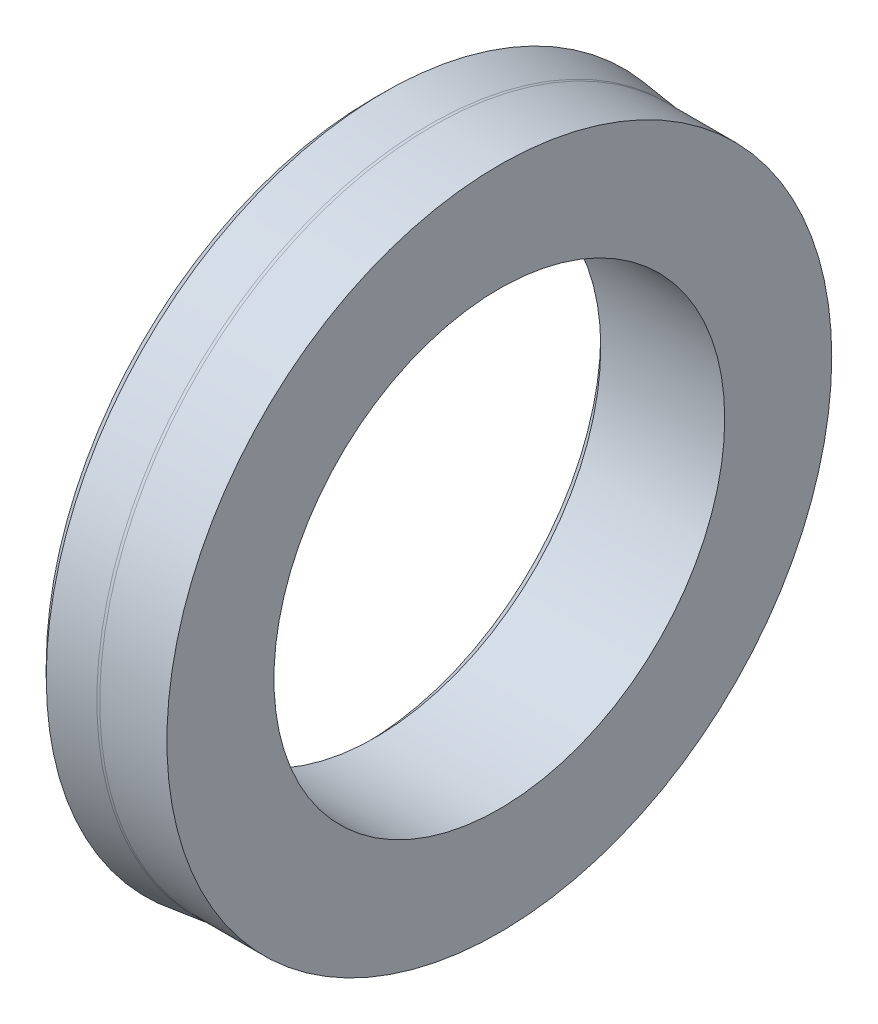
ISO-10303-21;
HEADER;
FILE_DESCRIPTION(('STEP AP214'),'2;1');
FILE_NAME('part.step','',(''),(''),'','','');
FILE_SCHEMA(('AUTOMOTIVE_DESIGN { 1 0 10303 214 1 1 1 1 }'));
ENDSEC;
DATA;
#1=APPLICATION_CONTEXT('core data for automotive mechanical design processes');
#2=APPLICATION_PROTOCOL_DEFINITION('international standard','automotive_design',2000,#1);
#3=PRODUCT_CONTEXT('',#1,'mechanical');
#4=PRODUCT('Part','Part','',(#3));
#5=PRODUCT_RELATED_PRODUCT_CATEGORY('part','',(#4));
#6=PRODUCT_DEFINITION_FORMATION('','',#4);
#7=PRODUCT_DEFINITION_CONTEXT('part definition',#1,'design');
#8=PRODUCT_DEFINITION('design','',#6,#7);
#9=PRODUCT_DEFINITION_SHAPE('','',#8);
#10=(LENGTH_UNIT() NAMED_UNIT(*) SI_UNIT(.MILLI.,.METRE.));
#11=(NAMED_UNIT(*) PLANE_ANGLE_UNIT() SI_UNIT($,.RADIAN.));
#12=(NAMED_UNIT(*) SI_UNIT($,.STERADIAN.) SOLID_ANGLE_UNIT());
#13=UNCERTAINTY_MEASURE_WITH_UNIT(LENGTH_MEASURE(1.E-05),#10,'distance_accuracy_value','');
#14=(GEOMETRIC_REPRESENTATION_CONTEXT(3) GLOBAL_UNCERTAINTY_ASSIGNED_CONTEXT((#13)) GLOBAL_UNIT_ASSIGNED_CONTEXT((#10,
#11,#12)) REPRESENTATION_CONTEXT('',''));
#15=CARTESIAN_POINT('',(0.,0.,0.));
#16=DIRECTION('',(0.,0.,1.));
#17=DIRECTION('',(1.,0.,0.));
#18=AXIS2_PLACEMENT_3D('',#15,#16,#17);
#19=CARTESIAN_POINT('',(584.921248789932,446.502634686379,0.));
#20=DIRECTION('',(-1.,0.,0.));
#21=DIRECTION('',(0.,0.,1.));
#22=AXIS2_PLACEMENT_3D('',#19,#20,#21);
#23=CONICAL_SURFACE('',#22,21.,0.785398163397448);
#24=CARTESIAN_POINT('',(585.921248789932,446.502634686379,0.));
#25=DIRECTION('',(1.,0.,0.));
#26=DIRECTION('',(0.,0.,-1.));
#27=AXIS2_PLACEMENT_3D('',#24,#25,#26);
#28=CIRCLE('',#27,20.);
#29=CARTESIAN_POINT('',(585.921248789932,446.502634686379,-20.));
#30=VERTEX_POINT('',#29);
#31=EDGE_CURVE('E70',#30,#30,#28,.T.);
#32=ORIENTED_EDGE('',*,*,#31,.T.);
#33=EDGE_LOOP('',(#32));
#34=FACE_BOUND('',#33,.T.);
#35=CARTESIAN_POINT('',(584.921248789932,446.502634686379,0.));
#36=DIRECTION('',(1.,0.,0.));
#37=DIRECTION('',(0.,0.,-1.));
#38=AXIS2_PLACEMENT_3D('',#35,#36,#37);
#39=CIRCLE('',#38,21.);
#40=CARTESIAN_POINT('',(584.921248789932,446.502634686379,-21.));
#41=VERTEX_POINT('',#40);
#42=EDGE_CURVE('E10',#41,#41,#39,.T.);
#43=ORIENTED_EDGE('',*,*,#42,.F.);
#44=EDGE_LOOP('',(#43));
#45=FACE_BOUND('',#44,.T.);
#46=ADVANCED_FACE('F30',(#34,#45),#23,.F.);
#47=CARTESIAN_POINT('',(584.921248789932,470.502634686379,0.));
#48=DIRECTION('',(-1.,0.,0.));
#49=DIRECTION('',(0.,0.,1.));
#50=AXIS2_PLACEMENT_3D('',#47,#48,#49);
#51=PLANE('',#50);
#52=ORIENTED_EDGE('',*,*,#42,.T.);
#53=EDGE_LOOP('',(#52));
#54=FACE_BOUND('',#53,.T.);
#55=CARTESIAN_POINT('',(584.921248789932,446.502634686379,0.));
#56=DIRECTION('',(1.,0.,0.));
#57=DIRECTION('',(0.,0.,-1.));
#58=AXIS2_PLACEMENT_3D('',#55,#56,#57);
#59=CIRCLE('',#58,24.);
#60=CARTESIAN_POINT('',(584.921248789932,446.502634686379,-24.));
#61=VERTEX_POINT('',#60);
#62=EDGE_CURVE('E36',#61,#61,#59,.T.);
#63=ORIENTED_EDGE('',*,*,#62,.F.);
#64=EDGE_LOOP('',(#63));
#65=FACE_BOUND('',#64,.T.);
#66=ADVANCED_FACE('F88',(#54,#65),#51,.T.);
#67=CARTESIAN_POINT('',(596.921248789932,446.502634686379,0.));
#68=DIRECTION('',(1.,0.,0.));
#69=DIRECTION('',(0.,0.,-1.));
#70=AXIS2_PLACEMENT_3D('',#67,#68,#69);
#71=CYLINDRICAL_SURFACE('',#70,23.9999999999999);
#72=ORIENTED_EDGE('',*,*,#62,.T.);
#73=EDGE_LOOP('',(#72));
#74=FACE_BOUND('',#73,.T.);
#75=CARTESIAN_POINT('',(589.403609649424,446.502634686379,0.));
#76=DIRECTION('',(1.,0.,0.));
#77=DIRECTION('',(0.,0.,-1.));
#78=AXIS2_PLACEMENT_3D('',#75,#76,#77);
#79=CIRCLE('',#78,23.9999999999999);
#80=CARTESIAN_POINT('',(589.403609649424,446.502634686379,-23.9999999999999));
#81=VERTEX_POINT('',#80);
#82=EDGE_CURVE('E40',#81,#81,#79,.T.);
#83=ORIENTED_EDGE('',*,*,#82,.F.);
#84=EDGE_LOOP('',(#83));
#85=FACE_BOUND('',#84,.T.);
#86=ADVANCED_FACE('F92',(#74,#85),#71,.T.);
#87=CARTESIAN_POINT('',(589.403609649424,446.502634686379,0.));
#88=DIRECTION('',(1.,0.,0.));
#89=DIRECTION('',(0.,0.,-1.));
#90=AXIS2_PLACEMENT_3D('',#87,#88,#89);
#91=TOROIDAL_SURFACE('',#90,24.8176391405087,0.817639140508125);
#92=ORIENTED_EDGE('',*,*,#82,.T.);
#93=EDGE_LOOP('',(#92));
#94=FACE_BOUND('',#93,.T.);
#95=CARTESIAN_POINT('',(589.503056579504,446.502634686379,0.));
#96=DIRECTION('',(1.,0.,0.));
#97=DIRECTION('',(0.,0.,-1.));
#98=AXIS2_PLACEMENT_3D('',#95,#96,#97);
#99=CIRCLE('',#98,25.629208036036);
#100=CARTESIAN_POINT('',(589.503056579504,446.502634686379,-25.629208036036));
#101=VERTEX_POINT('',#100);
#102=EDGE_CURVE('E44',#101,#101,#99,.T.);
#103=ORIENTED_EDGE('',*,*,#102,.F.);
#104=EDGE_LOOP('',(#103));
#105=FACE_BOUND('',#104,.T.);
#106=ADVANCED_FACE('F96',(#94,#105),#91,.F.);
#107=CARTESIAN_POINT('',(585.721248789932,446.502634686379,0.));
#108=DIRECTION('',(-1.,0.,0.));
#109=DIRECTION('',(0.,0.,1.));
#110=AXIS2_PLACEMENT_3D('',#107,#108,#109);
#111=CONICAL_SURFACE('',#110,26.092618076633,0.121928807026452);
#112=ORIENTED_EDGE('',*,*,#102,.T.);
#113=EDGE_LOOP('',(#112));
#114=FACE_BOUND('',#113,.T.);
#115=CARTESIAN_POINT('',(585.721248789932,446.502634686379,0.));
#116=DIRECTION('',(1.,0.,0.));
#117=DIRECTION('',(0.,0.,-1.));
#118=AXIS2_PLACEMENT_3D('',#115,#116,#117);
#119=CIRCLE('',#118,26.092618076633);
#120=CARTESIAN_POINT('',(585.721248789932,446.502634686379,-26.092618076633));
#121=VERTEX_POINT('',#120);
#122=EDGE_CURVE('E49',#121,#121,#119,.T.);
#123=ORIENTED_EDGE('',*,*,#122,.F.);
#124=EDGE_LOOP('',(#123));
#125=FACE_BOUND('',#124,.T.);
#126=ADVANCED_FACE('F102',(#114,#125),#111,.F.);
#127=CARTESIAN_POINT('',(585.721248789932,475.502634686379,0.));
#128=DIRECTION('',(-1.,0.,0.));
#129=DIRECTION('',(0.,0.,1.));
#130=AXIS2_PLACEMENT_3D('',#127,#128,#129);
#131=PLANE('',#130);
#132=ORIENTED_EDGE('',*,*,#122,.T.);
#133=EDGE_LOOP('',(#132));
#134=FACE_BOUND('',#133,.T.);
#135=CARTESIAN_POINT('',(585.721248789932,446.502634686379,0.));
#136=DIRECTION('',(1.,0.,0.));
#137=DIRECTION('',(0.,0.,-1.));
#138=AXIS2_PLACEMENT_3D('',#135,#136,#137);
#139=CIRCLE('',#138,29.);
#140=CARTESIAN_POINT('',(585.721248789932,446.502634686379,-29.0000000000001));
#141=VERTEX_POINT('',#140);
#142=EDGE_CURVE('E52',#141,#141,#139,.T.);
#143=ORIENTED_EDGE('',*,*,#142,.F.);
#144=EDGE_LOOP('',(#143));
#145=FACE_BOUND('',#144,.T.);
#146=ADVANCED_FACE('F106',(#134,#145),#131,.T.);
#147=CARTESIAN_POINT('',(586.721248789932,446.502634686379,0.));
#148=DIRECTION('',(1.,0.,0.));
#149=DIRECTION('',(0.,0.,-1.));
#150=AXIS2_PLACEMENT_3D('',#147,#148,#149);
#151=CONICAL_SURFACE('',#150,30.,0.785398163397448);
#152=ORIENTED_EDGE('',*,*,#142,.T.);
#153=EDGE_LOOP('',(#152));
#154=FACE_BOUND('',#153,.T.);
#155=CARTESIAN_POINT('',(586.721248789932,446.502634686379,0.));
#156=DIRECTION('',(1.,0.,0.));
#157=DIRECTION('',(0.,0.,-1.));
#158=AXIS2_PLACEMENT_3D('',#155,#156,#157);
#159=CIRCLE('',#158,30.);
#160=CARTESIAN_POINT('',(586.721248789932,446.502634686379,-30.0000000000001));
#161=VERTEX_POINT('',#160);
#162=EDGE_CURVE('E55',#161,#161,#159,.T.);
#163=ORIENTED_EDGE('',*,*,#162,.F.);
#164=EDGE_LOOP('',(#163));
#165=FACE_BOUND('',#164,.T.);
#166=ADVANCED_FACE('F110',(#154,#165),#151,.T.);
#167=CARTESIAN_POINT('',(590.721291167577,446.502634686379,0.));
#168=DIRECTION('',(-1.,0.,0.));
#169=DIRECTION('',(0.,0.,1.));
#170=AXIS2_PLACEMENT_3D('',#167,#168,#169);
#171=CONICAL_SURFACE('',#170,29.50984822504,0.121928807026576);
#172=ORIENTED_EDGE('',*,*,#162,.T.);
#173=EDGE_LOOP('',(#172));
#174=FACE_BOUND('',#173,.T.);
#175=CARTESIAN_POINT('',(590.721291167577,446.502634686379,0.));
#176=DIRECTION('',(1.,0.,0.));
#177=DIRECTION('',(0.,0.,-1.));
#178=AXIS2_PLACEMENT_3D('',#175,#176,#177);
#179=CIRCLE('',#178,29.50984822504);
#180=CARTESIAN_POINT('',(590.721291167577,446.502634686379,-29.5098482250401));
#181=VERTEX_POINT('',#180);
#182=EDGE_CURVE('E58',#181,#181,#179,.T.);
#183=ORIENTED_EDGE('',*,*,#182,.F.);
#184=EDGE_LOOP('',(#183));
#185=FACE_BOUND('',#184,.T.);
#186=ADVANCED_FACE('F114',(#174,#185),#171,.T.);
#187=CARTESIAN_POINT('',(590.964545006963,446.502634686379,0.));
#188=DIRECTION('',(1.,0.,0.));
#189=DIRECTION('',(0.,0.,-1.));
#190=AXIS2_PLACEMENT_3D('',#187,#188,#189);
#191=TOROIDAL_SURFACE('',#190,31.4950000000493,2.00000000004973);
#192=ORIENTED_EDGE('',*,*,#182,.T.);
#193=EDGE_LOOP('',(#192));
#194=FACE_BOUND('',#193,.T.);
#195=CARTESIAN_POINT('',(590.964545006961,446.502634686379,0.));
#196=DIRECTION('',(1.,0.,0.));
#197=DIRECTION('',(0.,0.,-1.));
#198=AXIS2_PLACEMENT_3D('',#195,#196,#197);
#199=CIRCLE('',#198,29.4949999999996);
#200=CARTESIAN_POINT('',(590.964545006961,446.502634686379,-29.4949999999996));
#201=VERTEX_POINT('',#200);
#202=EDGE_CURVE('E61',#201,#201,#199,.T.);
#203=ORIENTED_EDGE('',*,*,#202,.F.);
#204=EDGE_LOOP('',(#203));
#205=FACE_BOUND('',#204,.T.);
#206=ADVANCED_FACE('F118',(#194,#205),#191,.F.);
#207=CARTESIAN_POINT('',(596.921248789932,446.502634686379,0.));
#208=DIRECTION('',(1.,0.,0.));
#209=DIRECTION('',(0.,0.,-1.));
#210=AXIS2_PLACEMENT_3D('',#207,#208,#209);
#211=CYLINDRICAL_SURFACE('',#210,29.4949999999998);
#212=ORIENTED_EDGE('',*,*,#202,.T.);
#213=EDGE_LOOP('',(#212));
#214=FACE_BOUND('',#213,.T.);
#215=CARTESIAN_POINT('',(596.921248789932,446.502634686379,0.));
#216=DIRECTION('',(1.,0.,0.));
#217=DIRECTION('',(0.,0.,-1.));
#218=AXIS2_PLACEMENT_3D('',#215,#216,#217);
#219=CIRCLE('',#218,29.495);
#220=CARTESIAN_POINT('',(596.921248789932,446.502634686379,-29.495));
#221=VERTEX_POINT('',#220);
#222=EDGE_CURVE('E64',#221,#221,#219,.T.);
#223=ORIENTED_EDGE('',*,*,#222,.F.);
#224=EDGE_LOOP('',(#223));
#225=FACE_BOUND('',#224,.T.);
#226=ADVANCED_FACE('F84',(#214,#225),#211,.T.);
#227=CARTESIAN_POINT('',(596.921248789932,466.502634686379,0.));
#228=DIRECTION('',(1.,0.,0.));
#229=DIRECTION('',(0.,0.,-1.));
#230=AXIS2_PLACEMENT_3D('',#227,#228,#229);
#231=PLANE('',#230);
#232=ORIENTED_EDGE('',*,*,#222,.T.);
#233=EDGE_LOOP('',(#232));
#234=FACE_BOUND('',#233,.T.);
#235=CARTESIAN_POINT('',(596.921248789932,446.502634686379,0.));
#236=DIRECTION('',(1.,0.,0.));
#237=DIRECTION('',(0.,0.,-1.));
#238=AXIS2_PLACEMENT_3D('',#235,#236,#237);
#239=CIRCLE('',#238,20.);
#240=CARTESIAN_POINT('',(596.921248789932,446.502634686379,-20.));
#241=VERTEX_POINT('',#240);
#242=EDGE_CURVE('E67',#241,#241,#239,.T.);
#243=ORIENTED_EDGE('',*,*,#242,.F.);
#244=EDGE_LOOP('',(#243));
#245=FACE_BOUND('',#244,.T.);
#246=ADVANCED_FACE('F78',(#234,#245),#231,.T.);
#247=CARTESIAN_POINT('',(596.921248789932,446.502634686379,0.));
#248=DIRECTION('',(1.,0.,0.));
#249=DIRECTION('',(0.,0.,-1.));
#250=AXIS2_PLACEMENT_3D('',#247,#248,#249);
#251=CYLINDRICAL_SURFACE('',#250,20.);
#252=ORIENTED_EDGE('',*,*,#242,.T.);
#253=EDGE_LOOP('',(#252));
#254=FACE_BOUND('',#253,.T.);
#255=ORIENTED_EDGE('',*,*,#31,.F.);
#256=EDGE_LOOP('',(#255));
#257=FACE_BOUND('',#256,.T.);
#258=ADVANCED_FACE('F76',(#254,#257),#251,.F.);
#259=CLOSED_SHELL('',(#46,#66,#86,#106,#126,#146,#166,#186,#206,#226,#246,#258));
#260=MANIFOLD_SOLID_BREP('B2',#259);
#261=ADVANCED_BREP_SHAPE_REPRESENTATION('',(#18,#260),#14);
#262=SHAPE_DEFINITION_REPRESENTATION(#9,#261);
ENDSEC;
END-ISO-10303-21;
